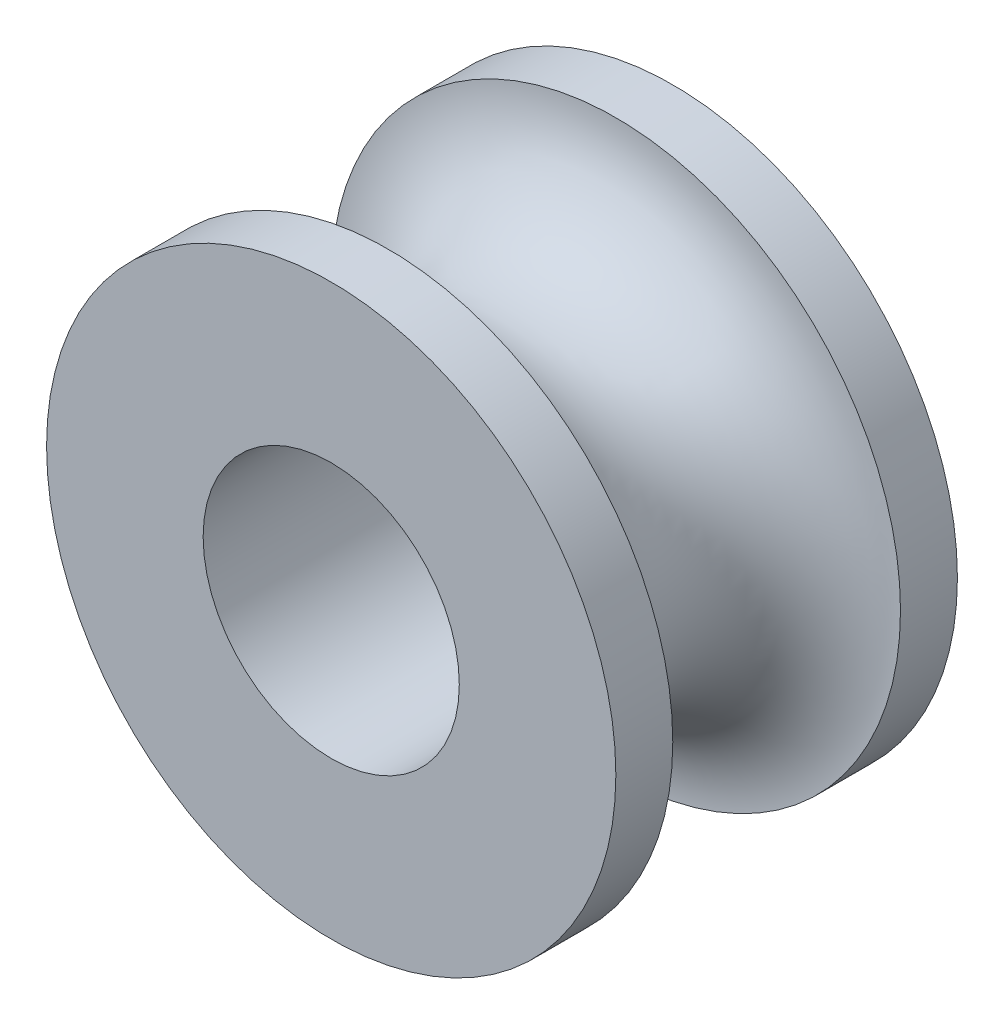
ISO-10303-21;
HEADER;
FILE_DESCRIPTION(('STEP AP214'),'2;1');
FILE_NAME('part.step','',(''),(''),'','','');
FILE_SCHEMA(('AUTOMOTIVE_DESIGN { 1 0 10303 214 1 1 1 1 }'));
ENDSEC;
DATA;
#1=APPLICATION_CONTEXT('core data for automotive mechanical design processes');
#2=APPLICATION_PROTOCOL_DEFINITION('international standard','automotive_design',2000,#1);
#3=PRODUCT_CONTEXT('',#1,'mechanical');
#4=PRODUCT('Part','Part','',(#3));
#5=PRODUCT_RELATED_PRODUCT_CATEGORY('part','',(#4));
#6=PRODUCT_DEFINITION_FORMATION('','',#4);
#7=PRODUCT_DEFINITION_CONTEXT('part definition',#1,'design');
#8=PRODUCT_DEFINITION('design','',#6,#7);
#9=PRODUCT_DEFINITION_SHAPE('','',#8);
#10=(LENGTH_UNIT() NAMED_UNIT(*) SI_UNIT(.MILLI.,.METRE.));
#11=(NAMED_UNIT(*) PLANE_ANGLE_UNIT() SI_UNIT($,.RADIAN.));
#12=(NAMED_UNIT(*) SI_UNIT($,.STERADIAN.) SOLID_ANGLE_UNIT());
#13=UNCERTAINTY_MEASURE_WITH_UNIT(LENGTH_MEASURE(1.E-05),#10,'distance_accuracy_value','');
#14=(GEOMETRIC_REPRESENTATION_CONTEXT(3) GLOBAL_UNCERTAINTY_ASSIGNED_CONTEXT((#13)) GLOBAL_UNIT_ASSIGNED_CONTEXT((#10,
#11,#12)) REPRESENTATION_CONTEXT('',''));
#15=CARTESIAN_POINT('',(0.,0.,0.));
#16=DIRECTION('',(0.,0.,1.));
#17=DIRECTION('',(1.,0.,0.));
#18=AXIS2_PLACEMENT_3D('',#15,#16,#17);
#19=CARTESIAN_POINT('',(0.,0.,6.));
#20=DIRECTION('',(0.,0.,-1.));
#21=DIRECTION('',(-1.,0.,0.));
#22=AXIS2_PLACEMENT_3D('',#19,#20,#21);
#23=CYLINDRICAL_SURFACE('',#22,5.);
#24=CARTESIAN_POINT('',(0.,0.,1.));
#25=DIRECTION('',(0.,0.,-1.));
#26=DIRECTION('',(-1.,0.,0.));
#27=AXIS2_PLACEMENT_3D('',#24,#25,#26);
#28=CIRCLE('',#27,5.);
#29=CARTESIAN_POINT('',(-5.,0.,1.));
#30=VERTEX_POINT('',#29);
#31=EDGE_CURVE('E46',#30,#30,#28,.T.);
#32=ORIENTED_EDGE('',*,*,#31,.T.);
#33=EDGE_LOOP('',(#32));
#34=FACE_BOUND('',#33,.T.);
#35=CARTESIAN_POINT('',(0.,0.,0.));
#36=DIRECTION('',(0.,0.,1.));
#37=DIRECTION('',(1.,0.,0.));
#38=AXIS2_PLACEMENT_3D('',#35,#36,#37);
#39=CIRCLE('',#38,5.);
#40=CARTESIAN_POINT('',(5.,0.,0.));
#41=VERTEX_POINT('',#40);
#42=EDGE_CURVE('E34',#41,#41,#39,.T.);
#43=ORIENTED_EDGE('',*,*,#42,.T.);
#44=EDGE_LOOP('',(#43));
#45=FACE_BOUND('',#44,.T.);
#46=ADVANCED_FACE('F30',(#34,#45),#23,.T.);
#47=CARTESIAN_POINT('',(0.,0.,6.));
#48=DIRECTION('',(0.,0.,1.));
#49=DIRECTION('',(1.,0.,0.));
#50=AXIS2_PLACEMENT_3D('',#47,#48,#49);
#51=PLANE('',#50);
#52=CARTESIAN_POINT('',(0.,0.,6.));
#53=DIRECTION('',(0.,0.,1.));
#54=DIRECTION('',(1.,0.,0.));
#55=AXIS2_PLACEMENT_3D('',#52,#53,#54);
#56=CIRCLE('',#55,5.);
#57=CARTESIAN_POINT('',(5.,0.,6.));
#58=VERTEX_POINT('',#57);
#59=EDGE_CURVE('E10',#58,#58,#56,.T.);
#60=ORIENTED_EDGE('',*,*,#59,.T.);
#61=EDGE_LOOP('',(#60));
#62=FACE_BOUND('',#61,.T.);
#63=CARTESIAN_POINT('',(0.,0.,6.));
#64=DIRECTION('',(0.,0.,1.));
#65=DIRECTION('',(1.,0.,0.));
#66=AXIS2_PLACEMENT_3D('',#63,#64,#65);
#67=CIRCLE('',#66,2.25);
#68=CARTESIAN_POINT('',(2.25,0.,6.));
#69=VERTEX_POINT('',#68);
#70=EDGE_CURVE('E41',#69,#69,#67,.T.);
#71=ORIENTED_EDGE('',*,*,#70,.F.);
#72=EDGE_LOOP('',(#71));
#73=FACE_BOUND('',#72,.T.);
#74=ADVANCED_FACE('F67',(#62,#73),#51,.T.);
#75=CARTESIAN_POINT('',(0.,0.,0.));
#76=DIRECTION('',(0.,0.,1.));
#77=DIRECTION('',(1.,0.,0.));
#78=AXIS2_PLACEMENT_3D('',#75,#76,#77);
#79=PLANE('',#78);
#80=ORIENTED_EDGE('',*,*,#42,.F.);
#81=EDGE_LOOP('',(#80));
#82=FACE_BOUND('',#81,.T.);
#83=CARTESIAN_POINT('',(0.,0.,0.));
#84=DIRECTION('',(0.,0.,1.));
#85=DIRECTION('',(1.,0.,0.));
#86=AXIS2_PLACEMENT_3D('',#83,#84,#85);
#87=CIRCLE('',#86,2.25);
#88=CARTESIAN_POINT('',(2.25,0.,0.));
#89=VERTEX_POINT('',#88);
#90=EDGE_CURVE('E43',#89,#89,#87,.T.);
#91=ORIENTED_EDGE('',*,*,#90,.T.);
#92=EDGE_LOOP('',(#91));
#93=FACE_BOUND('',#92,.T.);
#94=ADVANCED_FACE('F60',(#82,#93),#79,.F.);
#95=CARTESIAN_POINT('',(0.,0.,5.));
#96=DIRECTION('',(0.,0.,-1.));
#97=DIRECTION('',(-1.,0.,0.));
#98=AXIS2_PLACEMENT_3D('',#95,#96,#97);
#99=CIRCLE('',#98,5.);
#100=CARTESIAN_POINT('',(-5.,0.,5.));
#101=VERTEX_POINT('',#100);
#102=EDGE_CURVE('E51',#101,#101,#99,.T.);
#103=ORIENTED_EDGE('',*,*,#102,.F.);
#104=EDGE_LOOP('',(#103));
#105=FACE_BOUND('',#104,.T.);
#106=ORIENTED_EDGE('',*,*,#59,.F.);
#107=EDGE_LOOP('',(#106));
#108=FACE_BOUND('',#107,.T.);
#109=ADVANCED_FACE('F32',(#105,#108),#23,.T.);
#110=CARTESIAN_POINT('',(0.,0.,6.));
#111=DIRECTION('',(0.,0.,-1.));
#112=DIRECTION('',(-1.,0.,0.));
#113=AXIS2_PLACEMENT_3D('',#110,#111,#112);
#114=CYLINDRICAL_SURFACE('',#113,2.25);
#115=ORIENTED_EDGE('',*,*,#70,.T.);
#116=EDGE_LOOP('',(#115));
#117=FACE_BOUND('',#116,.T.);
#118=ORIENTED_EDGE('',*,*,#90,.F.);
#119=EDGE_LOOP('',(#118));
#120=FACE_BOUND('',#119,.T.);
#121=ADVANCED_FACE('F59',(#117,#120),#114,.F.);
#122=CARTESIAN_POINT('',(0.,0.,3.));
#123=DIRECTION('',(0.,0.,-1.));
#124=DIRECTION('',(-1.,0.,0.));
#125=AXIS2_PLACEMENT_3D('',#122,#123,#124);
#126=TOROIDAL_SURFACE('',#125,5.,2.);
#127=ORIENTED_EDGE('',*,*,#31,.F.);
#128=EDGE_LOOP('',(#127));
#129=FACE_BOUND('',#128,.T.);
#130=ORIENTED_EDGE('',*,*,#102,.T.);
#131=EDGE_LOOP('',(#130));
#132=FACE_BOUND('',#131,.T.);
#133=ADVANCED_FACE('F55',(#129,#132),#126,.F.);
#134=CLOSED_SHELL('',(#46,#74,#94,#109,#121,#133));
#135=MANIFOLD_SOLID_BREP('B2',#134);
#136=ADVANCED_BREP_SHAPE_REPRESENTATION('',(#18,#135),#14);
#137=SHAPE_DEFINITION_REPRESENTATION(#9,#136);
ENDSEC;
END-ISO-10303-21;
